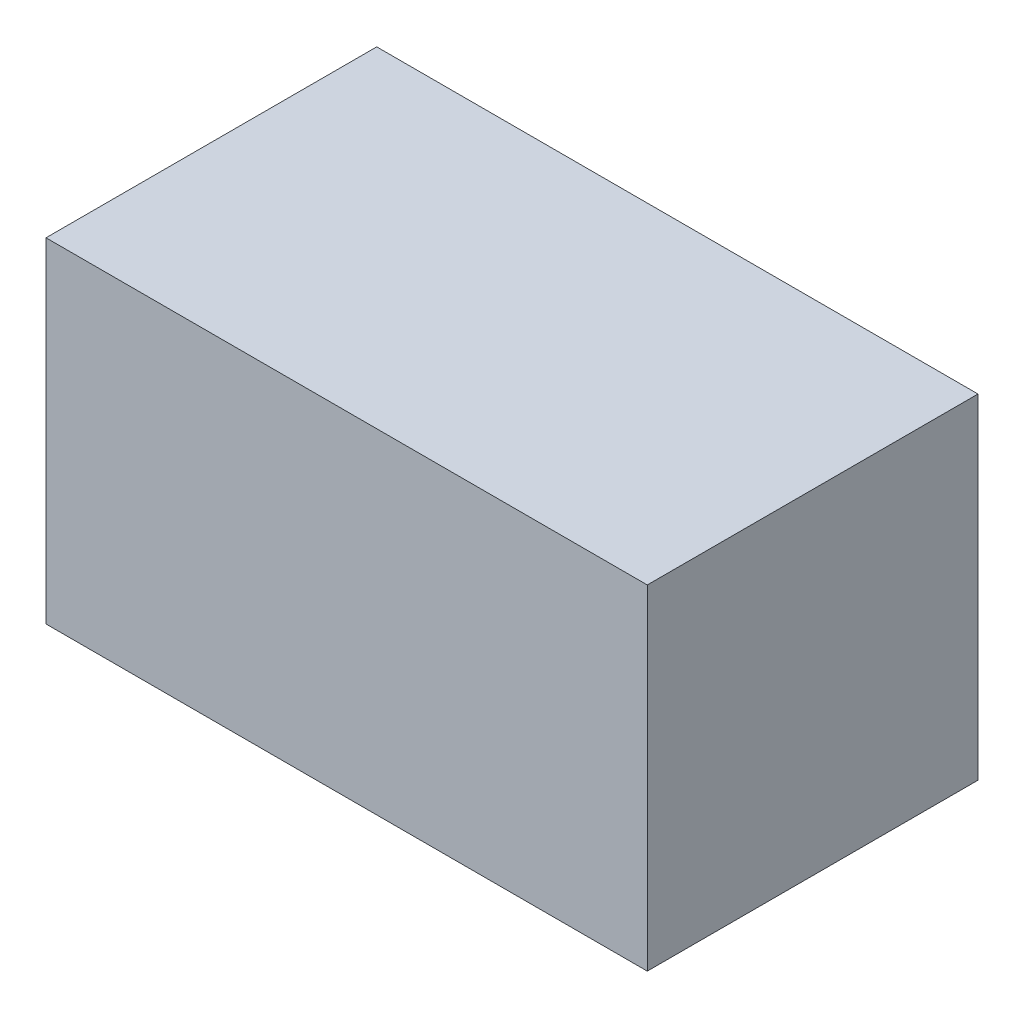
ISO-10303-21;
HEADER;
FILE_DESCRIPTION(('STEP AP214'),'2;1');
FILE_NAME('part.step','',(''),(''),'','','');
FILE_SCHEMA(('AUTOMOTIVE_DESIGN { 1 0 10303 214 1 1 1 1 }'));
ENDSEC;
DATA;
#1=APPLICATION_CONTEXT('core data for automotive mechanical design processes');
#2=APPLICATION_PROTOCOL_DEFINITION('international standard','automotive_design',2000,#1);
#3=PRODUCT_CONTEXT('',#1,'mechanical');
#4=PRODUCT('Part','Part','',(#3));
#5=PRODUCT_RELATED_PRODUCT_CATEGORY('part','',(#4));
#6=PRODUCT_DEFINITION_FORMATION('','',#4);
#7=PRODUCT_DEFINITION_CONTEXT('part definition',#1,'design');
#8=PRODUCT_DEFINITION('design','',#6,#7);
#9=PRODUCT_DEFINITION_SHAPE('','',#8);
#10=(LENGTH_UNIT() NAMED_UNIT(*) SI_UNIT(.MILLI.,.METRE.));
#11=(NAMED_UNIT(*) PLANE_ANGLE_UNIT() SI_UNIT($,.RADIAN.));
#12=(NAMED_UNIT(*) SI_UNIT($,.STERADIAN.) SOLID_ANGLE_UNIT());
#13=UNCERTAINTY_MEASURE_WITH_UNIT(LENGTH_MEASURE(1.E-05),#10,'distance_accuracy_value','');
#14=(GEOMETRIC_REPRESENTATION_CONTEXT(3) GLOBAL_UNCERTAINTY_ASSIGNED_CONTEXT((#13)) GLOBAL_UNIT_ASSIGNED_CONTEXT((#10,
#11,#12)) REPRESENTATION_CONTEXT('',''));
#15=CARTESIAN_POINT('',(0.,0.,0.));
#16=DIRECTION('',(0.,0.,1.));
#17=DIRECTION('',(1.,0.,0.));
#18=AXIS2_PLACEMENT_3D('',#15,#16,#17);
#19=CARTESIAN_POINT('',(8.,8.9,4.4));
#20=DIRECTION('',(-1.,0.,0.));
#21=DIRECTION('',(0.,0.,1.));
#22=AXIS2_PLACEMENT_3D('',#19,#20,#21);
#23=PLANE('',#22);
#24=DIRECTION('',(0.,0.,-1.));
#25=VECTOR('',#24,1.);
#26=CARTESIAN_POINT('',(8.,0.,4.4));
#27=LINE('',#26,#25);
#28=CARTESIAN_POINT('',(8.,0.,4.4));
#29=VERTEX_POINT('',#28);
#30=CARTESIAN_POINT('',(8.,0.,-4.4));
#31=VERTEX_POINT('',#30);
#32=EDGE_CURVE('E96',#29,#31,#27,.T.);
#33=ORIENTED_EDGE('',*,*,#32,.T.);
#34=DIRECTION('',(0.,-1.,0.));
#35=VECTOR('',#34,1.);
#36=CARTESIAN_POINT('',(8.,8.9,-4.4));
#37=LINE('',#36,#35);
#38=CARTESIAN_POINT('',(8.,8.9,-4.4));
#39=VERTEX_POINT('',#38);
#40=EDGE_CURVE('E11',#39,#31,#37,.T.);
#41=ORIENTED_EDGE('',*,*,#40,.F.);
#42=DIRECTION('',(0.,0.,-1.));
#43=VECTOR('',#42,1.);
#44=CARTESIAN_POINT('',(8.,8.9,4.4));
#45=LINE('',#44,#43);
#46=CARTESIAN_POINT('',(8.,8.9,4.4));
#47=VERTEX_POINT('',#46);
#48=EDGE_CURVE('E84',#47,#39,#45,.T.);
#49=ORIENTED_EDGE('',*,*,#48,.F.);
#50=DIRECTION('',(0.,-1.,0.));
#51=VECTOR('',#50,1.);
#52=CARTESIAN_POINT('',(8.,8.9,4.4));
#53=LINE('',#52,#51);
#54=EDGE_CURVE('E92',#47,#29,#53,.T.);
#55=ORIENTED_EDGE('',*,*,#54,.T.);
#56=EDGE_LOOP('',(#33,#41,#49,#55));
#57=FACE_BOUND('',#56,.T.);
#58=ADVANCED_FACE('F33',(#57),#23,.F.);
#59=CARTESIAN_POINT('',(-8.,8.9,-4.4));
#60=DIRECTION('',(0.,0.,1.));
#61=DIRECTION('',(1.,0.,0.));
#62=AXIS2_PLACEMENT_3D('',#59,#60,#61);
#63=PLANE('',#62);
#64=DIRECTION('',(-1.,0.,0.));
#65=VECTOR('',#64,1.);
#66=CARTESIAN_POINT('',(-8.,0.,-4.4));
#67=LINE('',#66,#65);
#68=CARTESIAN_POINT('',(-8.,0.,-4.4));
#69=VERTEX_POINT('',#68);
#70=EDGE_CURVE('E88',#31,#69,#67,.T.);
#71=ORIENTED_EDGE('',*,*,#70,.T.);
#72=DIRECTION('',(0.,-1.,0.));
#73=VECTOR('',#72,1.);
#74=CARTESIAN_POINT('',(-8.,8.9,-4.4));
#75=LINE('',#74,#73);
#76=CARTESIAN_POINT('',(-8.,8.9,-4.4));
#77=VERTEX_POINT('',#76);
#78=EDGE_CURVE('E41',#77,#69,#75,.T.);
#79=ORIENTED_EDGE('',*,*,#78,.F.);
#80=DIRECTION('',(-1.,0.,0.));
#81=VECTOR('',#80,1.);
#82=CARTESIAN_POINT('',(-8.,8.9,-4.4));
#83=LINE('',#82,#81);
#84=EDGE_CURVE('E79',#39,#77,#83,.T.);
#85=ORIENTED_EDGE('',*,*,#84,.F.);
#86=ORIENTED_EDGE('',*,*,#40,.T.);
#87=EDGE_LOOP('',(#71,#79,#85,#86));
#88=FACE_BOUND('',#87,.T.);
#89=ADVANCED_FACE('F87',(#88),#63,.F.);
#90=CARTESIAN_POINT('',(-8.,8.9,4.4));
#91=DIRECTION('',(1.,0.,0.));
#92=DIRECTION('',(0.,0.,-1.));
#93=AXIS2_PLACEMENT_3D('',#90,#91,#92);
#94=PLANE('',#93);
#95=DIRECTION('',(0.,0.,1.));
#96=VECTOR('',#95,1.);
#97=CARTESIAN_POINT('',(-8.,0.,4.4));
#98=LINE('',#97,#96);
#99=CARTESIAN_POINT('',(-8.,0.,4.4));
#100=VERTEX_POINT('',#99);
#101=EDGE_CURVE('E66',#69,#100,#98,.T.);
#102=ORIENTED_EDGE('',*,*,#101,.T.);
#103=DIRECTION('',(0.,-1.,0.));
#104=VECTOR('',#103,1.);
#105=CARTESIAN_POINT('',(-8.,8.9,4.4));
#106=LINE('',#105,#104);
#107=CARTESIAN_POINT('',(-8.,8.9,4.4));
#108=VERTEX_POINT('',#107);
#109=EDGE_CURVE('E89',#108,#100,#106,.T.);
#110=ORIENTED_EDGE('',*,*,#109,.F.);
#111=DIRECTION('',(0.,0.,1.));
#112=VECTOR('',#111,1.);
#113=CARTESIAN_POINT('',(-8.,8.9,4.4));
#114=LINE('',#113,#112);
#115=EDGE_CURVE('E82',#77,#108,#114,.T.);
#116=ORIENTED_EDGE('',*,*,#115,.F.);
#117=ORIENTED_EDGE('',*,*,#78,.T.);
#118=EDGE_LOOP('',(#102,#110,#116,#117));
#119=FACE_BOUND('',#118,.T.);
#120=ADVANCED_FACE('F90',(#119),#94,.F.);
#121=CARTESIAN_POINT('',(-8.,8.9,4.4));
#122=DIRECTION('',(0.,0.,-1.));
#123=DIRECTION('',(-1.,0.,0.));
#124=AXIS2_PLACEMENT_3D('',#121,#122,#123);
#125=PLANE('',#124);
#126=DIRECTION('',(1.,0.,0.));
#127=VECTOR('',#126,1.);
#128=CARTESIAN_POINT('',(-8.,0.,4.4));
#129=LINE('',#128,#127);
#130=EDGE_CURVE('E72',#100,#29,#129,.T.);
#131=ORIENTED_EDGE('',*,*,#130,.T.);
#132=ORIENTED_EDGE('',*,*,#54,.F.);
#133=DIRECTION('',(1.,0.,0.));
#134=VECTOR('',#133,1.);
#135=CARTESIAN_POINT('',(-8.,8.9,4.4));
#136=LINE('',#135,#134);
#137=EDGE_CURVE('E49',#108,#47,#136,.T.);
#138=ORIENTED_EDGE('',*,*,#137,.F.);
#139=ORIENTED_EDGE('',*,*,#109,.T.);
#140=EDGE_LOOP('',(#131,#132,#138,#139));
#141=FACE_BOUND('',#140,.T.);
#142=ADVANCED_FACE('F103',(#141),#125,.F.);
#143=CARTESIAN_POINT('',(0.,8.9,0.));
#144=DIRECTION('',(0.,-1.,0.));
#145=DIRECTION('',(0.,0.,-1.));
#146=AXIS2_PLACEMENT_3D('',#143,#144,#145);
#147=PLANE('',#146);
#148=ORIENTED_EDGE('',*,*,#48,.T.);
#149=ORIENTED_EDGE('',*,*,#84,.T.);
#150=ORIENTED_EDGE('',*,*,#115,.T.);
#151=ORIENTED_EDGE('',*,*,#137,.T.);
#152=EDGE_LOOP('',(#148,#149,#150,#151));
#153=FACE_BOUND('',#152,.T.);
#154=ADVANCED_FACE('F80',(#153),#147,.F.);
#155=CARTESIAN_POINT('',(0.,0.,0.));
#156=DIRECTION('',(0.,-1.,0.));
#157=DIRECTION('',(0.,0.,-1.));
#158=AXIS2_PLACEMENT_3D('',#155,#156,#157);
#159=PLANE('',#158);
#160=ORIENTED_EDGE('',*,*,#32,.F.);
#161=ORIENTED_EDGE('',*,*,#130,.F.);
#162=ORIENTED_EDGE('',*,*,#101,.F.);
#163=ORIENTED_EDGE('',*,*,#70,.F.);
#164=EDGE_LOOP('',(#160,#161,#162,#163));
#165=FACE_BOUND('',#164,.T.);
#166=ADVANCED_FACE('F106',(#165),#159,.T.);
#167=CLOSED_SHELL('',(#58,#89,#120,#142,#154,#166));
#168=MANIFOLD_SOLID_BREP('B2',#167);
#169=ADVANCED_BREP_SHAPE_REPRESENTATION('',(#18,#168),#14);
#170=SHAPE_DEFINITION_REPRESENTATION(#9,#169);
ENDSEC;
END-ISO-10303-21;
